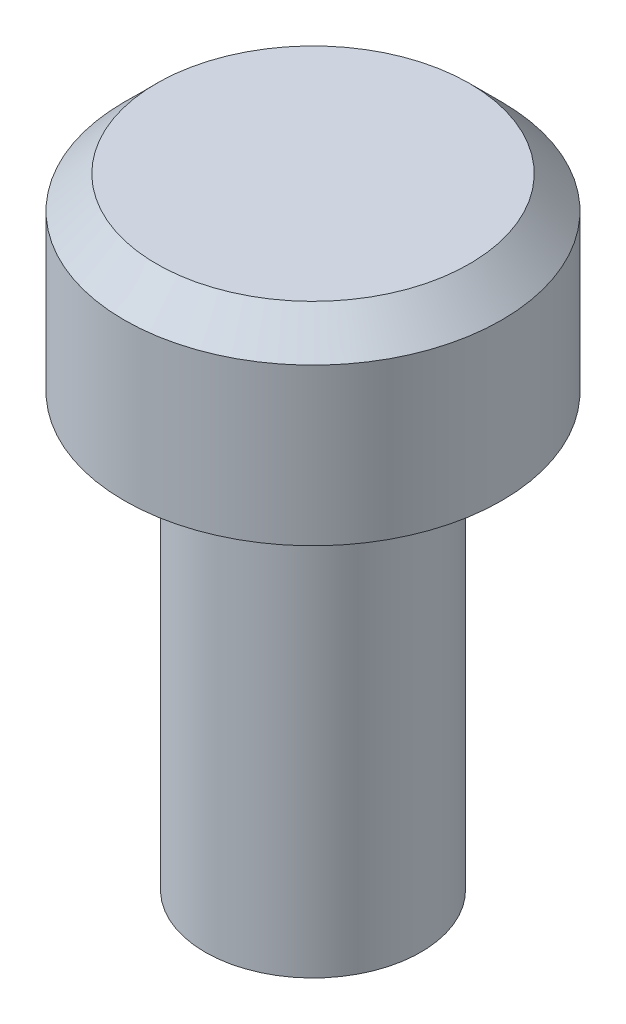
ISO-10303-21;
HEADER;
FILE_DESCRIPTION(('STEP AP214'),'2;1');
FILE_NAME('part.step','',(''),(''),'','','');
FILE_SCHEMA(('AUTOMOTIVE_DESIGN { 1 0 10303 214 1 1 1 1 }'));
ENDSEC;
DATA;
#1=APPLICATION_CONTEXT('core data for automotive mechanical design processes');
#2=APPLICATION_PROTOCOL_DEFINITION('international standard','automotive_design',2000,#1);
#3=PRODUCT_CONTEXT('',#1,'mechanical');
#4=PRODUCT('Part','Part','',(#3));
#5=PRODUCT_RELATED_PRODUCT_CATEGORY('part','',(#4));
#6=PRODUCT_DEFINITION_FORMATION('','',#4);
#7=PRODUCT_DEFINITION_CONTEXT('part definition',#1,'design');
#8=PRODUCT_DEFINITION('design','',#6,#7);
#9=PRODUCT_DEFINITION_SHAPE('','',#8);
#10=(LENGTH_UNIT() NAMED_UNIT(*) SI_UNIT(.MILLI.,.METRE.));
#11=(NAMED_UNIT(*) PLANE_ANGLE_UNIT() SI_UNIT($,.RADIAN.));
#12=(NAMED_UNIT(*) SI_UNIT($,.STERADIAN.) SOLID_ANGLE_UNIT());
#13=UNCERTAINTY_MEASURE_WITH_UNIT(LENGTH_MEASURE(1.E-05),#10,'distance_accuracy_value','');
#14=(GEOMETRIC_REPRESENTATION_CONTEXT(3) GLOBAL_UNCERTAINTY_ASSIGNED_CONTEXT((#13)) GLOBAL_UNIT_ASSIGNED_CONTEXT((#10,
#11,#12)) REPRESENTATION_CONTEXT('',''));
#15=CARTESIAN_POINT('',(0.,0.,0.));
#16=DIRECTION('',(0.,0.,1.));
#17=DIRECTION('',(1.,0.,0.));
#18=AXIS2_PLACEMENT_3D('',#15,#16,#17);
#19=CARTESIAN_POINT('',(0.,-4.60269038161211,0.));
#20=DIRECTION('',(0.,-1.,0.));
#21=DIRECTION('',(0.,0.,-1.));
#22=AXIS2_PLACEMENT_3D('',#19,#20,#21);
#23=CYLINDRICAL_SURFACE('',#22,1.);
#24=CARTESIAN_POINT('',(0.,-4.,0.));
#25=DIRECTION('',(0.,-1.,0.));
#26=DIRECTION('',(0.,0.,-1.));
#27=AXIS2_PLACEMENT_3D('',#24,#25,#26);
#28=CIRCLE('',#27,1.);
#29=CARTESIAN_POINT('',(0.,-4.,-1.));
#30=VERTEX_POINT('',#29);
#31=EDGE_CURVE('E51',#30,#30,#28,.T.);
#32=ORIENTED_EDGE('',*,*,#31,.F.);
#33=EDGE_LOOP('',(#32));
#34=FACE_BOUND('',#33,.T.);
#35=CARTESIAN_POINT('',(0.,0.,0.));
#36=DIRECTION('',(0.,-1.,0.));
#37=DIRECTION('',(0.,0.,-1.));
#38=AXIS2_PLACEMENT_3D('',#35,#36,#37);
#39=CIRCLE('',#38,1.);
#40=CARTESIAN_POINT('',(0.,0.,-1.));
#41=VERTEX_POINT('',#40);
#42=EDGE_CURVE('E10',#41,#41,#39,.T.);
#43=ORIENTED_EDGE('',*,*,#42,.T.);
#44=EDGE_LOOP('',(#43));
#45=FACE_BOUND('',#44,.T.);
#46=ADVANCED_FACE('F32',(#34,#45),#23,.T.);
#47=CARTESIAN_POINT('',(-1.,0.,0.));
#48=DIRECTION('',(0.,1.,0.));
#49=DIRECTION('',(0.,0.,1.));
#50=AXIS2_PLACEMENT_3D('',#47,#48,#49);
#51=PLANE('',#50);
#52=ORIENTED_EDGE('',*,*,#42,.F.);
#53=EDGE_LOOP('',(#52));
#54=FACE_BOUND('',#53,.T.);
#55=CARTESIAN_POINT('',(0.,0.,0.));
#56=DIRECTION('',(0.,-1.,0.));
#57=DIRECTION('',(0.,0.,-1.));
#58=AXIS2_PLACEMENT_3D('',#55,#56,#57);
#59=CIRCLE('',#58,1.75);
#60=CARTESIAN_POINT('',(0.,0.,-1.75));
#61=VERTEX_POINT('',#60);
#62=EDGE_CURVE('E38',#61,#61,#59,.T.);
#63=ORIENTED_EDGE('',*,*,#62,.T.);
#64=EDGE_LOOP('',(#63));
#65=FACE_BOUND('',#64,.T.);
#66=ADVANCED_FACE('F58',(#54,#65),#51,.F.);
#67=CARTESIAN_POINT('',(0.,-4.60269038161211,0.));
#68=DIRECTION('',(0.,-1.,0.));
#69=DIRECTION('',(0.,0.,-1.));
#70=AXIS2_PLACEMENT_3D('',#67,#68,#69);
#71=CYLINDRICAL_SURFACE('',#70,1.75);
#72=ORIENTED_EDGE('',*,*,#62,.F.);
#73=EDGE_LOOP('',(#72));
#74=FACE_BOUND('',#73,.T.);
#75=CARTESIAN_POINT('',(0.,1.45,0.));
#76=DIRECTION('',(0.,-1.,0.));
#77=DIRECTION('',(0.,0.,-1.));
#78=AXIS2_PLACEMENT_3D('',#75,#76,#77);
#79=CIRCLE('',#78,1.75);
#80=CARTESIAN_POINT('',(0.,1.45,-1.75));
#81=VERTEX_POINT('',#80);
#82=EDGE_CURVE('E42',#81,#81,#79,.T.);
#83=ORIENTED_EDGE('',*,*,#82,.T.);
#84=EDGE_LOOP('',(#83));
#85=FACE_BOUND('',#84,.T.);
#86=ADVANCED_FACE('F62',(#74,#85),#71,.T.);
#87=CARTESIAN_POINT('',(0.,1.75,0.));
#88=DIRECTION('',(0.,-1.,0.));
#89=DIRECTION('',(0.,0.,-1.));
#90=AXIS2_PLACEMENT_3D('',#87,#88,#89);
#91=CONICAL_SURFACE('',#90,1.45,0.785398163397448);
#92=ORIENTED_EDGE('',*,*,#82,.F.);
#93=EDGE_LOOP('',(#92));
#94=FACE_BOUND('',#93,.T.);
#95=CARTESIAN_POINT('',(0.,1.75,0.));
#96=DIRECTION('',(0.,-1.,0.));
#97=DIRECTION('',(0.,0.,-1.));
#98=AXIS2_PLACEMENT_3D('',#95,#96,#97);
#99=CIRCLE('',#98,1.45);
#100=CARTESIAN_POINT('',(0.,1.75,-1.45));
#101=VERTEX_POINT('',#100);
#102=EDGE_CURVE('E46',#101,#101,#99,.T.);
#103=ORIENTED_EDGE('',*,*,#102,.T.);
#104=EDGE_LOOP('',(#103));
#105=FACE_BOUND('',#104,.T.);
#106=ADVANCED_FACE('F67',(#94,#105),#91,.T.);
#107=CARTESIAN_POINT('',(0.,1.75,0.));
#108=DIRECTION('',(0.,-1.,0.));
#109=DIRECTION('',(0.,0.,-1.));
#110=AXIS2_PLACEMENT_3D('',#107,#108,#109);
#111=PLANE('',#110);
#112=ORIENTED_EDGE('',*,*,#102,.F.);
#113=EDGE_LOOP('',(#112));
#114=FACE_BOUND('',#113,.T.);
#115=ADVANCED_FACE('F73',(#114),#111,.F.);
#116=CARTESIAN_POINT('',(0.,-4.,0.));
#117=DIRECTION('',(0.,1.,0.));
#118=DIRECTION('',(0.,0.,1.));
#119=AXIS2_PLACEMENT_3D('',#116,#117,#118);
#120=PLANE('',#119);
#121=ORIENTED_EDGE('',*,*,#31,.T.);
#122=EDGE_LOOP('',(#121));
#123=FACE_BOUND('',#122,.T.);
#124=ADVANCED_FACE('F55',(#123),#120,.F.);
#125=CLOSED_SHELL('',(#46,#66,#86,#106,#115,#124));
#126=MANIFOLD_SOLID_BREP('B2',#125);
#127=ADVANCED_BREP_SHAPE_REPRESENTATION('',(#18,#126),#14);
#128=SHAPE_DEFINITION_REPRESENTATION(#9,#127);
ENDSEC;
END-ISO-10303-21;
